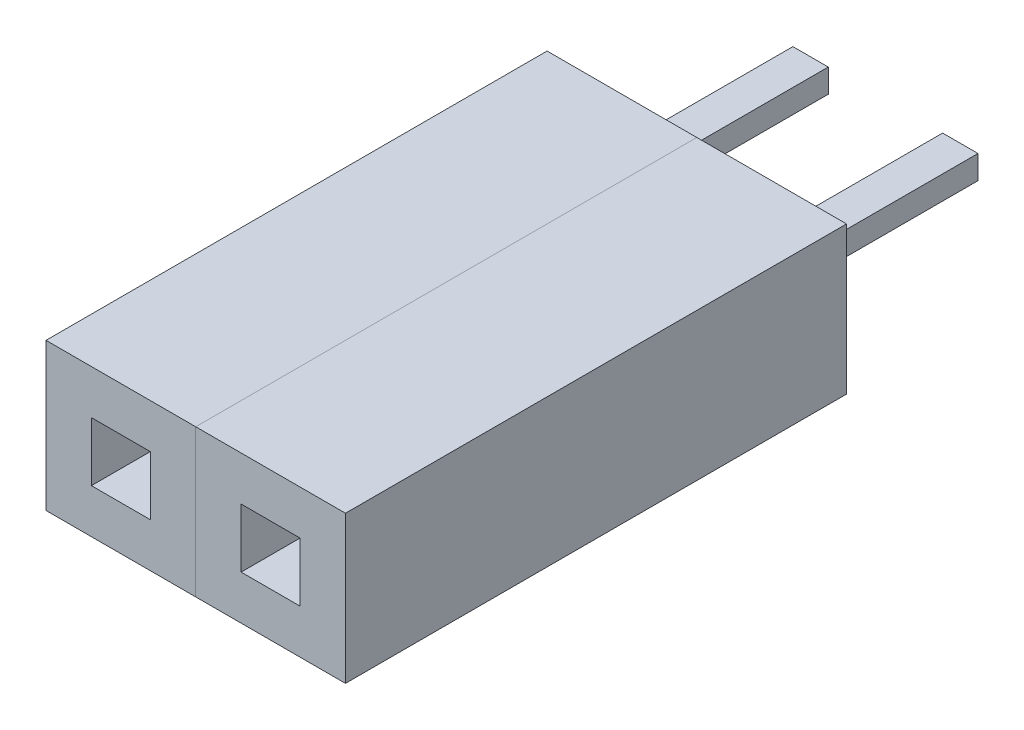
ISO-10303-21;
HEADER;
FILE_DESCRIPTION(('STEP AP214'),'2;1');
FILE_NAME('part.step','',(''),(''),'','','');
FILE_SCHEMA(('AUTOMOTIVE_DESIGN { 1 0 10303 214 1 1 1 1 }'));
ENDSEC;
DATA;
#1=APPLICATION_CONTEXT('core data for automotive mechanical design processes');
#2=APPLICATION_PROTOCOL_DEFINITION('international standard','automotive_design',2000,#1);
#3=PRODUCT_CONTEXT('',#1,'mechanical');
#4=PRODUCT('Part','Part','',(#3));
#5=PRODUCT_RELATED_PRODUCT_CATEGORY('part','',(#4));
#6=PRODUCT_DEFINITION_FORMATION('','',#4);
#7=PRODUCT_DEFINITION_CONTEXT('part definition',#1,'design');
#8=PRODUCT_DEFINITION('design','',#6,#7);
#9=PRODUCT_DEFINITION_SHAPE('','',#8);
#10=(LENGTH_UNIT() NAMED_UNIT(*) SI_UNIT(.MILLI.,.METRE.));
#11=(NAMED_UNIT(*) PLANE_ANGLE_UNIT() SI_UNIT($,.RADIAN.));
#12=(NAMED_UNIT(*) SI_UNIT($,.STERADIAN.) SOLID_ANGLE_UNIT());
#13=UNCERTAINTY_MEASURE_WITH_UNIT(LENGTH_MEASURE(1.E-05),#10,'distance_accuracy_value','');
#14=(GEOMETRIC_REPRESENTATION_CONTEXT(3) GLOBAL_UNCERTAINTY_ASSIGNED_CONTEXT((#13)) GLOBAL_UNIT_ASSIGNED_CONTEXT((#10,
#11,#12)) REPRESENTATION_CONTEXT('',''));
#15=CARTESIAN_POINT('',(0.,0.,0.));
#16=DIRECTION('',(0.,0.,1.));
#17=DIRECTION('',(1.,0.,0.));
#18=AXIS2_PLACEMENT_3D('',#15,#16,#17);
#19=CARTESIAN_POINT('',(22.48,-19.4244444444445,8.5));
#20=DIRECTION('',(0.,1.,0.));
#21=DIRECTION('',(1.,0.,0.));
#22=AXIS2_PLACEMENT_3D('',#19,#20,#21);
#23=PLANE('',#22);
#24=DIRECTION('',(1.,0.,0.));
#25=VECTOR('',#24,1.);
#26=CARTESIAN_POINT('',(22.48,-19.4244444444445,0.));
#27=LINE('',#26,#25);
#28=CARTESIAN_POINT('',(22.48,-19.4244444444445,0.));
#29=VERTEX_POINT('',#28);
#30=CARTESIAN_POINT('',(25.02,-19.4244444444445,0.));
#31=VERTEX_POINT('',#30);
#32=EDGE_CURVE('P0_E133',#29,#31,#27,.T.);
#33=ORIENTED_EDGE('',*,*,#32,.T.);
#34=DIRECTION('',(0.,0.,-1.));
#35=VECTOR('',#34,1.);
#36=CARTESIAN_POINT('',(25.02,-19.4244444444445,8.5));
#37=LINE('',#36,#35);
#38=CARTESIAN_POINT('',(25.02,-19.4244444444445,8.5));
#39=VERTEX_POINT('',#38);
#40=EDGE_CURVE('P0_E143',#39,#31,#37,.T.);
#41=ORIENTED_EDGE('',*,*,#40,.F.);
#42=DIRECTION('',(1.,0.,0.));
#43=VECTOR('',#42,1.);
#44=CARTESIAN_POINT('',(22.48,-19.4244444444445,8.5));
#45=LINE('',#44,#43);
#46=CARTESIAN_POINT('',(22.48,-19.4244444444445,8.5));
#47=VERTEX_POINT('',#46);
#48=EDGE_CURVE('P0_E148',#47,#39,#45,.T.);
#49=ORIENTED_EDGE('',*,*,#48,.F.);
#50=DIRECTION('',(0.,0.,-1.));
#51=VECTOR('',#50,1.);
#52=CARTESIAN_POINT('',(22.48,-19.4244444444445,8.5));
#53=LINE('',#52,#51);
#54=EDGE_CURVE('P0_E116',#47,#29,#53,.T.);
#55=ORIENTED_EDGE('',*,*,#54,.T.);
#56=EDGE_LOOP('',(#33,#41,#49,#55));
#57=FACE_BOUND('',#56,.T.);
#58=ADVANCED_FACE('P0_F17',(#57),#23,.F.);
#59=CARTESIAN_POINT('',(23.25,-17.6744444444444,1.5));
#60=DIRECTION('',(0.,0.,-1.));
#61=DIRECTION('',(0.,-1.,0.));
#62=AXIS2_PLACEMENT_3D('',#59,#60,#61);
#63=PLANE('',#62);
#64=DIRECTION('',(0.,1.,0.));
#65=VECTOR('',#64,1.);
#66=CARTESIAN_POINT('',(23.25,-18.6744444444444,1.5));
#67=LINE('',#66,#65);
#68=CARTESIAN_POINT('',(23.25,-18.6744444444444,1.5));
#69=VERTEX_POINT('',#68);
#70=CARTESIAN_POINT('',(23.25,-17.6744444444444,1.5));
#71=VERTEX_POINT('',#70);
#72=EDGE_CURVE('P0_E21',#69,#71,#67,.T.);
#73=ORIENTED_EDGE('',*,*,#72,.F.);
#74=DIRECTION('',(-1.,0.,0.));
#75=VECTOR('',#74,1.);
#76=CARTESIAN_POINT('',(24.25,-18.6744444444444,1.5));
#77=LINE('',#76,#75);
#78=CARTESIAN_POINT('',(24.25,-18.6744444444444,1.5));
#79=VERTEX_POINT('',#78);
#80=EDGE_CURVE('P0_E11',#79,#69,#77,.T.);
#81=ORIENTED_EDGE('',*,*,#80,.F.);
#82=DIRECTION('',(0.,-1.,0.));
#83=VECTOR('',#82,1.);
#84=CARTESIAN_POINT('',(24.25,-17.6744444444444,1.5));
#85=LINE('',#84,#83);
#86=CARTESIAN_POINT('',(24.25,-17.6744444444444,1.5));
#87=VERTEX_POINT('',#86);
#88=EDGE_CURVE('P0_E94',#87,#79,#85,.T.);
#89=ORIENTED_EDGE('',*,*,#88,.F.);
#90=DIRECTION('',(1.,0.,0.));
#91=VECTOR('',#90,1.);
#92=CARTESIAN_POINT('',(23.25,-17.6744444444444,1.5));
#93=LINE('',#92,#91);
#94=EDGE_CURVE('P0_E88',#71,#87,#93,.T.);
#95=ORIENTED_EDGE('',*,*,#94,.F.);
#96=EDGE_LOOP('',(#73,#81,#89,#95));
#97=FACE_BOUND('',#96,.T.);
#98=ADVANCED_FACE('P0_F90',(#97),#63,.F.);
#99=CARTESIAN_POINT('',(24.25,-18.6744444444444,1.5));
#100=DIRECTION('',(0.,1.,0.));
#101=DIRECTION('',(1.,0.,0.));
#102=AXIS2_PLACEMENT_3D('',#99,#100,#101);
#103=PLANE('',#102);
#104=DIRECTION('',(-1.,0.,0.));
#105=VECTOR('',#104,1.);
#106=CARTESIAN_POINT('',(24.25,-18.6744444444444,8.5));
#107=LINE('',#106,#105);
#108=CARTESIAN_POINT('',(24.25,-18.6744444444444,8.5));
#109=VERTEX_POINT('',#108);
#110=CARTESIAN_POINT('',(23.25,-18.6744444444444,8.5));
#111=VERTEX_POINT('',#110);
#112=EDGE_CURVE('P0_E147',#109,#111,#107,.T.);
#113=ORIENTED_EDGE('',*,*,#112,.F.);
#114=DIRECTION('',(0.,0.,1.));
#115=VECTOR('',#114,1.);
#116=CARTESIAN_POINT('',(24.25,-18.6744444444444,1.5));
#117=LINE('',#116,#115);
#118=EDGE_CURVE('P0_E28',#79,#109,#117,.T.);
#119=ORIENTED_EDGE('',*,*,#118,.F.);
#120=ORIENTED_EDGE('',*,*,#80,.T.);
#121=DIRECTION('',(0.,0.,1.));
#122=VECTOR('',#121,1.);
#123=CARTESIAN_POINT('',(23.25,-18.6744444444444,1.5));
#124=LINE('',#123,#122);
#125=EDGE_CURVE('P0_E110',#69,#111,#124,.T.);
#126=ORIENTED_EDGE('',*,*,#125,.T.);
#127=EDGE_LOOP('',(#113,#119,#120,#126));
#128=FACE_BOUND('',#127,.T.);
#129=ADVANCED_FACE('P0_F249',(#128),#103,.T.);
#130=CARTESIAN_POINT('',(24.25,-17.6744444444444,1.5));
#131=DIRECTION('',(-1.,0.,0.));
#132=DIRECTION('',(0.,0.,1.));
#133=AXIS2_PLACEMENT_3D('',#130,#131,#132);
#134=PLANE('',#133);
#135=DIRECTION('',(0.,-1.,0.));
#136=VECTOR('',#135,1.);
#137=CARTESIAN_POINT('',(24.25,-17.6744444444444,8.5));
#138=LINE('',#137,#136);
#139=CARTESIAN_POINT('',(24.25,-17.6744444444444,8.5));
#140=VERTEX_POINT('',#139);
#141=EDGE_CURVE('P0_E123',#140,#109,#138,.T.);
#142=ORIENTED_EDGE('',*,*,#141,.F.);
#143=DIRECTION('',(0.,0.,1.));
#144=VECTOR('',#143,1.);
#145=CARTESIAN_POINT('',(24.25,-17.6744444444444,1.5));
#146=LINE('',#145,#144);
#147=EDGE_CURVE('P0_E98',#87,#140,#146,.T.);
#148=ORIENTED_EDGE('',*,*,#147,.F.);
#149=ORIENTED_EDGE('',*,*,#88,.T.);
#150=ORIENTED_EDGE('',*,*,#118,.T.);
#151=EDGE_LOOP('',(#142,#148,#149,#150));
#152=FACE_BOUND('',#151,.T.);
#153=ADVANCED_FACE('P0_F245',(#152),#134,.T.);
#154=CARTESIAN_POINT('',(23.25,-17.6744444444444,1.5));
#155=DIRECTION('',(0.,-1.,0.));
#156=DIRECTION('',(0.,0.,-1.));
#157=AXIS2_PLACEMENT_3D('',#154,#155,#156);
#158=PLANE('',#157);
#159=DIRECTION('',(1.,0.,0.));
#160=VECTOR('',#159,1.);
#161=CARTESIAN_POINT('',(23.25,-17.6744444444444,8.5));
#162=LINE('',#161,#160);
#163=CARTESIAN_POINT('',(23.25,-17.6744444444444,8.5));
#164=VERTEX_POINT('',#163);
#165=EDGE_CURVE('P0_E104',#164,#140,#162,.T.);
#166=ORIENTED_EDGE('',*,*,#165,.F.);
#167=DIRECTION('',(0.,0.,1.));
#168=VECTOR('',#167,1.);
#169=CARTESIAN_POINT('',(23.25,-17.6744444444444,1.5));
#170=LINE('',#169,#168);
#171=EDGE_CURVE('P0_E99',#71,#164,#170,.T.);
#172=ORIENTED_EDGE('',*,*,#171,.F.);
#173=ORIENTED_EDGE('',*,*,#94,.T.);
#174=ORIENTED_EDGE('',*,*,#147,.T.);
#175=EDGE_LOOP('',(#166,#172,#173,#174));
#176=FACE_BOUND('',#175,.T.);
#177=ADVANCED_FACE('P0_F102',(#176),#158,.T.);
#178=CARTESIAN_POINT('',(23.25,-18.6744444444444,1.5));
#179=DIRECTION('',(1.,0.,0.));
#180=DIRECTION('',(0.,1.,0.));
#181=AXIS2_PLACEMENT_3D('',#178,#179,#180);
#182=PLANE('',#181);
#183=DIRECTION('',(0.,1.,0.));
#184=VECTOR('',#183,1.);
#185=CARTESIAN_POINT('',(23.25,-18.6744444444444,8.5));
#186=LINE('',#185,#184);
#187=EDGE_CURVE('P0_E144',#111,#164,#186,.T.);
#188=ORIENTED_EDGE('',*,*,#187,.F.);
#189=ORIENTED_EDGE('',*,*,#125,.F.);
#190=ORIENTED_EDGE('',*,*,#72,.T.);
#191=ORIENTED_EDGE('',*,*,#171,.T.);
#192=EDGE_LOOP('',(#188,#189,#190,#191));
#193=FACE_BOUND('',#192,.T.);
#194=ADVANCED_FACE('P0_F19',(#193),#182,.T.);
#195=CARTESIAN_POINT('',(22.48,-16.9244444444444,8.5));
#196=DIRECTION('',(1.,0.,0.));
#197=DIRECTION('',(0.,1.,0.));
#198=AXIS2_PLACEMENT_3D('',#195,#196,#197);
#199=PLANE('',#198);
#200=DIRECTION('',(0.,-1.,0.));
#201=VECTOR('',#200,1.);
#202=CARTESIAN_POINT('',(22.48,-16.9244444444444,0.));
#203=LINE('',#202,#201);
#204=CARTESIAN_POINT('',(22.48,-16.9244444444444,0.));
#205=VERTEX_POINT('',#204);
#206=EDGE_CURVE('P0_E164',#205,#29,#203,.T.);
#207=ORIENTED_EDGE('',*,*,#206,.T.);
#208=ORIENTED_EDGE('',*,*,#54,.F.);
#209=DIRECTION('',(0.,-1.,0.));
#210=VECTOR('',#209,1.);
#211=CARTESIAN_POINT('',(22.48,-16.9244444444444,8.5));
#212=LINE('',#211,#210);
#213=CARTESIAN_POINT('',(22.48,-16.9244444444444,8.5));
#214=VERTEX_POINT('',#213);
#215=EDGE_CURVE('P0_E150',#214,#47,#212,.T.);
#216=ORIENTED_EDGE('',*,*,#215,.F.);
#217=DIRECTION('',(0.,0.,-1.));
#218=VECTOR('',#217,1.);
#219=CARTESIAN_POINT('',(22.48,-16.9244444444444,8.5));
#220=LINE('',#219,#218);
#221=EDGE_CURVE('P0_E126',#214,#205,#220,.T.);
#222=ORIENTED_EDGE('',*,*,#221,.T.);
#223=EDGE_LOOP('',(#207,#208,#216,#222));
#224=FACE_BOUND('',#223,.T.);
#225=ADVANCED_FACE('P0_F196',(#224),#199,.F.);
#226=CARTESIAN_POINT('',(22.48,-19.4244444444445,8.5));
#227=DIRECTION('',(0.,0.,1.));
#228=DIRECTION('',(1.,0.,0.));
#229=AXIS2_PLACEMENT_3D('',#226,#227,#228);
#230=PLANE('',#229);
#231=ORIENTED_EDGE('',*,*,#112,.T.);
#232=ORIENTED_EDGE('',*,*,#187,.T.);
#233=ORIENTED_EDGE('',*,*,#165,.T.);
#234=ORIENTED_EDGE('',*,*,#141,.T.);
#235=EDGE_LOOP('',(#231,#232,#233,#234));
#236=FACE_BOUND('',#235,.T.);
#237=ORIENTED_EDGE('',*,*,#215,.T.);
#238=ORIENTED_EDGE('',*,*,#48,.T.);
#239=DIRECTION('',(0.,1.,0.));
#240=VECTOR('',#239,1.);
#241=CARTESIAN_POINT('',(25.02,-19.4244444444445,8.5));
#242=LINE('',#241,#240);
#243=CARTESIAN_POINT('',(25.02,-16.9244444444444,8.5));
#244=VERTEX_POINT('',#243);
#245=EDGE_CURVE('P0_E136',#39,#244,#242,.T.);
#246=ORIENTED_EDGE('',*,*,#245,.T.);
#247=DIRECTION('',(-1.,0.,0.));
#248=VECTOR('',#247,1.);
#249=CARTESIAN_POINT('',(25.02,-16.9244444444444,8.5));
#250=LINE('',#249,#248);
#251=EDGE_CURVE('P0_E179',#244,#214,#250,.T.);
#252=ORIENTED_EDGE('',*,*,#251,.T.);
#253=EDGE_LOOP('',(#237,#238,#246,#252));
#254=FACE_BOUND('',#253,.T.);
#255=ADVANCED_FACE('P0_F278',(#236,#254),#230,.T.);
#256=CARTESIAN_POINT('',(25.02,-19.4244444444445,8.5));
#257=DIRECTION('',(-1.,0.,0.));
#258=DIRECTION('',(0.,0.,1.));
#259=AXIS2_PLACEMENT_3D('',#256,#257,#258);
#260=PLANE('',#259);
#261=DIRECTION('',(0.,1.,0.));
#262=VECTOR('',#261,1.);
#263=CARTESIAN_POINT('',(25.02,-19.4244444444445,0.));
#264=LINE('',#263,#262);
#265=CARTESIAN_POINT('',(25.02,-16.9244444444444,0.));
#266=VERTEX_POINT('',#265);
#267=EDGE_CURVE('P0_E137',#31,#266,#264,.T.);
#268=ORIENTED_EDGE('',*,*,#267,.T.);
#269=DIRECTION('',(0.,0.,-1.));
#270=VECTOR('',#269,1.);
#271=CARTESIAN_POINT('',(25.02,-16.9244444444444,8.5));
#272=LINE('',#271,#270);
#273=EDGE_CURVE('P0_E180',#244,#266,#272,.T.);
#274=ORIENTED_EDGE('',*,*,#273,.F.);
#275=ORIENTED_EDGE('',*,*,#245,.F.);
#276=ORIENTED_EDGE('',*,*,#40,.T.);
#277=EDGE_LOOP('',(#268,#274,#275,#276));
#278=FACE_BOUND('',#277,.T.);
#279=ADVANCED_FACE('P0_F268',(#278),#260,.F.);
#280=CARTESIAN_POINT('',(22.48,-19.4244444444445,0.));
#281=DIRECTION('',(0.,0.,1.));
#282=DIRECTION('',(1.,0.,0.));
#283=AXIS2_PLACEMENT_3D('',#280,#281,#282);
#284=PLANE('',#283);
#285=ORIENTED_EDGE('',*,*,#206,.F.);
#286=DIRECTION('',(-1.,0.,0.));
#287=VECTOR('',#286,1.);
#288=CARTESIAN_POINT('',(25.02,-16.9244444444444,0.));
#289=LINE('',#288,#287);
#290=EDGE_CURVE('P0_E129',#266,#205,#289,.T.);
#291=ORIENTED_EDGE('',*,*,#290,.F.);
#292=ORIENTED_EDGE('',*,*,#267,.F.);
#293=ORIENTED_EDGE('',*,*,#32,.F.);
#294=EDGE_LOOP('',(#285,#291,#292,#293));
#295=FACE_BOUND('',#294,.T.);
#296=ADVANCED_FACE('P0_F202',(#295),#284,.F.);
#297=CARTESIAN_POINT('',(25.02,-16.9244444444444,8.5));
#298=DIRECTION('',(0.,-1.,0.));
#299=DIRECTION('',(0.,0.,-1.));
#300=AXIS2_PLACEMENT_3D('',#297,#298,#299);
#301=PLANE('',#300);
#302=ORIENTED_EDGE('',*,*,#290,.T.);
#303=ORIENTED_EDGE('',*,*,#221,.F.);
#304=ORIENTED_EDGE('',*,*,#251,.F.);
#305=ORIENTED_EDGE('',*,*,#273,.T.);
#306=EDGE_LOOP('',(#302,#303,#304,#305));
#307=FACE_BOUND('',#306,.T.);
#308=ADVANCED_FACE('P0_F225',(#307),#301,.F.);
#309=CLOSED_SHELL('',(#58,#98,#129,#153,#177,#194,#225,#255,#279,#296,#308));
#310=MANIFOLD_SOLID_BREP('P0_B1',#309);
#311=CARTESIAN_POINT('',(25.02,-19.4244444444445,8.5));
#312=DIRECTION('',(0.,1.,0.));
#313=DIRECTION('',(1.,0.,0.));
#314=AXIS2_PLACEMENT_3D('',#311,#312,#313);
#315=PLANE('',#314);
#316=DIRECTION('',(1.,0.,0.));
#317=VECTOR('',#316,1.);
#318=CARTESIAN_POINT('',(25.02,-19.4244444444445,0.));
#319=LINE('',#318,#317);
#320=CARTESIAN_POINT('',(25.02,-19.4244444444445,0.));
#321=VERTEX_POINT('',#320);
#322=CARTESIAN_POINT('',(27.56,-19.4244444444445,0.));
#323=VERTEX_POINT('',#322);
#324=EDGE_CURVE('P1_E133',#321,#323,#319,.T.);
#325=ORIENTED_EDGE('',*,*,#324,.T.);
#326=DIRECTION('',(0.,0.,-1.));
#327=VECTOR('',#326,1.);
#328=CARTESIAN_POINT('',(27.56,-19.4244444444445,8.5));
#329=LINE('',#328,#327);
#330=CARTESIAN_POINT('',(27.56,-19.4244444444445,8.5));
#331=VERTEX_POINT('',#330);
#332=EDGE_CURVE('P1_E143',#331,#323,#329,.T.);
#333=ORIENTED_EDGE('',*,*,#332,.F.);
#334=DIRECTION('',(1.,0.,0.));
#335=VECTOR('',#334,1.);
#336=CARTESIAN_POINT('',(25.02,-19.4244444444445,8.5));
#337=LINE('',#336,#335);
#338=CARTESIAN_POINT('',(25.02,-19.4244444444445,8.5));
#339=VERTEX_POINT('',#338);
#340=EDGE_CURVE('P1_E148',#339,#331,#337,.T.);
#341=ORIENTED_EDGE('',*,*,#340,.F.);
#342=DIRECTION('',(0.,0.,-1.));
#343=VECTOR('',#342,1.);
#344=CARTESIAN_POINT('',(25.02,-19.4244444444445,8.5));
#345=LINE('',#344,#343);
#346=EDGE_CURVE('P1_E116',#339,#321,#345,.T.);
#347=ORIENTED_EDGE('',*,*,#346,.T.);
#348=EDGE_LOOP('',(#325,#333,#341,#347));
#349=FACE_BOUND('',#348,.T.);
#350=ADVANCED_FACE('P1_F17',(#349),#315,.F.);
#351=CARTESIAN_POINT('',(25.79,-17.6744444444444,1.5));
#352=DIRECTION('',(0.,0.,-1.));
#353=DIRECTION('',(0.,-1.,0.));
#354=AXIS2_PLACEMENT_3D('',#351,#352,#353);
#355=PLANE('',#354);
#356=DIRECTION('',(0.,1.,0.));
#357=VECTOR('',#356,1.);
#358=CARTESIAN_POINT('',(25.79,-18.6744444444444,1.5));
#359=LINE('',#358,#357);
#360=CARTESIAN_POINT('',(25.79,-18.6744444444444,1.5));
#361=VERTEX_POINT('',#360);
#362=CARTESIAN_POINT('',(25.79,-17.6744444444444,1.5));
#363=VERTEX_POINT('',#362);
#364=EDGE_CURVE('P1_E21',#361,#363,#359,.T.);
#365=ORIENTED_EDGE('',*,*,#364,.F.);
#366=DIRECTION('',(-1.,0.,0.));
#367=VECTOR('',#366,1.);
#368=CARTESIAN_POINT('',(26.79,-18.6744444444444,1.5));
#369=LINE('',#368,#367);
#370=CARTESIAN_POINT('',(26.79,-18.6744444444444,1.5));
#371=VERTEX_POINT('',#370);
#372=EDGE_CURVE('P1_E11',#371,#361,#369,.T.);
#373=ORIENTED_EDGE('',*,*,#372,.F.);
#374=DIRECTION('',(0.,-1.,0.));
#375=VECTOR('',#374,1.);
#376=CARTESIAN_POINT('',(26.79,-17.6744444444444,1.5));
#377=LINE('',#376,#375);
#378=CARTESIAN_POINT('',(26.79,-17.6744444444444,1.5));
#379=VERTEX_POINT('',#378);
#380=EDGE_CURVE('P1_E94',#379,#371,#377,.T.);
#381=ORIENTED_EDGE('',*,*,#380,.F.);
#382=DIRECTION('',(1.,0.,0.));
#383=VECTOR('',#382,1.);
#384=CARTESIAN_POINT('',(25.79,-17.6744444444444,1.5));
#385=LINE('',#384,#383);
#386=EDGE_CURVE('P1_E88',#363,#379,#385,.T.);
#387=ORIENTED_EDGE('',*,*,#386,.F.);
#388=EDGE_LOOP('',(#365,#373,#381,#387));
#389=FACE_BOUND('',#388,.T.);
#390=ADVANCED_FACE('P1_F90',(#389),#355,.F.);
#391=CARTESIAN_POINT('',(26.79,-18.6744444444444,1.5));
#392=DIRECTION('',(0.,1.,0.));
#393=DIRECTION('',(1.,0.,0.));
#394=AXIS2_PLACEMENT_3D('',#391,#392,#393);
#395=PLANE('',#394);
#396=DIRECTION('',(-1.,0.,0.));
#397=VECTOR('',#396,1.);
#398=CARTESIAN_POINT('',(26.79,-18.6744444444444,8.5));
#399=LINE('',#398,#397);
#400=CARTESIAN_POINT('',(26.79,-18.6744444444444,8.5));
#401=VERTEX_POINT('',#400);
#402=CARTESIAN_POINT('',(25.79,-18.6744444444444,8.5));
#403=VERTEX_POINT('',#402);
#404=EDGE_CURVE('P1_E147',#401,#403,#399,.T.);
#405=ORIENTED_EDGE('',*,*,#404,.F.);
#406=DIRECTION('',(0.,0.,1.));
#407=VECTOR('',#406,1.);
#408=CARTESIAN_POINT('',(26.79,-18.6744444444444,1.5));
#409=LINE('',#408,#407);
#410=EDGE_CURVE('P1_E28',#371,#401,#409,.T.);
#411=ORIENTED_EDGE('',*,*,#410,.F.);
#412=ORIENTED_EDGE('',*,*,#372,.T.);
#413=DIRECTION('',(0.,0.,1.));
#414=VECTOR('',#413,1.);
#415=CARTESIAN_POINT('',(25.79,-18.6744444444444,1.5));
#416=LINE('',#415,#414);
#417=EDGE_CURVE('P1_E110',#361,#403,#416,.T.);
#418=ORIENTED_EDGE('',*,*,#417,.T.);
#419=EDGE_LOOP('',(#405,#411,#412,#418));
#420=FACE_BOUND('',#419,.T.);
#421=ADVANCED_FACE('P1_F256',(#420),#395,.T.);
#422=CARTESIAN_POINT('',(26.79,-17.6744444444444,1.5));
#423=DIRECTION('',(-1.,0.,0.));
#424=DIRECTION('',(0.,0.,1.));
#425=AXIS2_PLACEMENT_3D('',#422,#423,#424);
#426=PLANE('',#425);
#427=DIRECTION('',(0.,-1.,0.));
#428=VECTOR('',#427,1.);
#429=CARTESIAN_POINT('',(26.79,-17.6744444444444,8.5));
#430=LINE('',#429,#428);
#431=CARTESIAN_POINT('',(26.79,-17.6744444444444,8.5));
#432=VERTEX_POINT('',#431);
#433=EDGE_CURVE('P1_E123',#432,#401,#430,.T.);
#434=ORIENTED_EDGE('',*,*,#433,.F.);
#435=DIRECTION('',(0.,0.,1.));
#436=VECTOR('',#435,1.);
#437=CARTESIAN_POINT('',(26.79,-17.6744444444444,1.5));
#438=LINE('',#437,#436);
#439=EDGE_CURVE('P1_E98',#379,#432,#438,.T.);
#440=ORIENTED_EDGE('',*,*,#439,.F.);
#441=ORIENTED_EDGE('',*,*,#380,.T.);
#442=ORIENTED_EDGE('',*,*,#410,.T.);
#443=EDGE_LOOP('',(#434,#440,#441,#442));
#444=FACE_BOUND('',#443,.T.);
#445=ADVANCED_FACE('P1_F251',(#444),#426,.T.);
#446=CARTESIAN_POINT('',(25.79,-17.6744444444444,1.5));
#447=DIRECTION('',(0.,-1.,0.));
#448=DIRECTION('',(0.,0.,-1.));
#449=AXIS2_PLACEMENT_3D('',#446,#447,#448);
#450=PLANE('',#449);
#451=DIRECTION('',(1.,0.,0.));
#452=VECTOR('',#451,1.);
#453=CARTESIAN_POINT('',(25.79,-17.6744444444444,8.5));
#454=LINE('',#453,#452);
#455=CARTESIAN_POINT('',(25.79,-17.6744444444444,8.5));
#456=VERTEX_POINT('',#455);
#457=EDGE_CURVE('P1_E104',#456,#432,#454,.T.);
#458=ORIENTED_EDGE('',*,*,#457,.F.);
#459=DIRECTION('',(0.,0.,1.));
#460=VECTOR('',#459,1.);
#461=CARTESIAN_POINT('',(25.79,-17.6744444444444,1.5));
#462=LINE('',#461,#460);
#463=EDGE_CURVE('P1_E99',#363,#456,#462,.T.);
#464=ORIENTED_EDGE('',*,*,#463,.F.);
#465=ORIENTED_EDGE('',*,*,#386,.T.);
#466=ORIENTED_EDGE('',*,*,#439,.T.);
#467=EDGE_LOOP('',(#458,#464,#465,#466));
#468=FACE_BOUND('',#467,.T.);
#469=ADVANCED_FACE('P1_F102',(#468),#450,.T.);
#470=CARTESIAN_POINT('',(25.79,-18.6744444444444,1.5));
#471=DIRECTION('',(1.,0.,0.));
#472=DIRECTION('',(0.,1.,0.));
#473=AXIS2_PLACEMENT_3D('',#470,#471,#472);
#474=PLANE('',#473);
#475=DIRECTION('',(0.,1.,0.));
#476=VECTOR('',#475,1.);
#477=CARTESIAN_POINT('',(25.79,-18.6744444444444,8.5));
#478=LINE('',#477,#476);
#479=EDGE_CURVE('P1_E144',#403,#456,#478,.T.);
#480=ORIENTED_EDGE('',*,*,#479,.F.);
#481=ORIENTED_EDGE('',*,*,#417,.F.);
#482=ORIENTED_EDGE('',*,*,#364,.T.);
#483=ORIENTED_EDGE('',*,*,#463,.T.);
#484=EDGE_LOOP('',(#480,#481,#482,#483));
#485=FACE_BOUND('',#484,.T.);
#486=ADVANCED_FACE('P1_F19',(#485),#474,.T.);
#487=CARTESIAN_POINT('',(25.02,-16.9244444444444,8.5));
#488=DIRECTION('',(1.,0.,0.));
#489=DIRECTION('',(0.,1.,0.));
#490=AXIS2_PLACEMENT_3D('',#487,#488,#489);
#491=PLANE('',#490);
#492=DIRECTION('',(0.,-1.,0.));
#493=VECTOR('',#492,1.);
#494=CARTESIAN_POINT('',(25.02,-16.9244444444444,0.));
#495=LINE('',#494,#493);
#496=CARTESIAN_POINT('',(25.02,-16.9244444444444,0.));
#497=VERTEX_POINT('',#496);
#498=EDGE_CURVE('P1_E164',#497,#321,#495,.T.);
#499=ORIENTED_EDGE('',*,*,#498,.T.);
#500=ORIENTED_EDGE('',*,*,#346,.F.);
#501=DIRECTION('',(0.,-1.,0.));
#502=VECTOR('',#501,1.);
#503=CARTESIAN_POINT('',(25.02,-16.9244444444444,8.5));
#504=LINE('',#503,#502);
#505=CARTESIAN_POINT('',(25.02,-16.9244444444444,8.5));
#506=VERTEX_POINT('',#505);
#507=EDGE_CURVE('P1_E150',#506,#339,#504,.T.);
#508=ORIENTED_EDGE('',*,*,#507,.F.);
#509=DIRECTION('',(0.,0.,-1.));
#510=VECTOR('',#509,1.);
#511=CARTESIAN_POINT('',(25.02,-16.9244444444444,8.5));
#512=LINE('',#511,#510);
#513=EDGE_CURVE('P1_E126',#506,#497,#512,.T.);
#514=ORIENTED_EDGE('',*,*,#513,.T.);
#515=EDGE_LOOP('',(#499,#500,#508,#514));
#516=FACE_BOUND('',#515,.T.);
#517=ADVANCED_FACE('P1_F196',(#516),#491,.F.);
#518=CARTESIAN_POINT('',(25.02,-19.4244444444445,8.5));
#519=DIRECTION('',(0.,0.,1.));
#520=DIRECTION('',(1.,0.,0.));
#521=AXIS2_PLACEMENT_3D('',#518,#519,#520);
#522=PLANE('',#521);
#523=ORIENTED_EDGE('',*,*,#404,.T.);
#524=ORIENTED_EDGE('',*,*,#479,.T.);
#525=ORIENTED_EDGE('',*,*,#457,.T.);
#526=ORIENTED_EDGE('',*,*,#433,.T.);
#527=EDGE_LOOP('',(#523,#524,#525,#526));
#528=FACE_BOUND('',#527,.T.);
#529=ORIENTED_EDGE('',*,*,#507,.T.);
#530=ORIENTED_EDGE('',*,*,#340,.T.);
#531=DIRECTION('',(0.,1.,0.));
#532=VECTOR('',#531,1.);
#533=CARTESIAN_POINT('',(27.56,-19.4244444444445,8.5));
#534=LINE('',#533,#532);
#535=CARTESIAN_POINT('',(27.56,-16.9244444444444,8.5));
#536=VERTEX_POINT('',#535);
#537=EDGE_CURVE('P1_E136',#331,#536,#534,.T.);
#538=ORIENTED_EDGE('',*,*,#537,.T.);
#539=DIRECTION('',(-1.,0.,0.));
#540=VECTOR('',#539,1.);
#541=CARTESIAN_POINT('',(27.56,-16.9244444444444,8.5));
#542=LINE('',#541,#540);
#543=EDGE_CURVE('P1_E179',#536,#506,#542,.T.);
#544=ORIENTED_EDGE('',*,*,#543,.T.);
#545=EDGE_LOOP('',(#529,#530,#538,#544));
#546=FACE_BOUND('',#545,.T.);
#547=ADVANCED_FACE('P1_F287',(#528,#546),#522,.T.);
#548=CARTESIAN_POINT('',(27.56,-19.4244444444445,8.5));
#549=DIRECTION('',(-1.,0.,0.));
#550=DIRECTION('',(0.,0.,1.));
#551=AXIS2_PLACEMENT_3D('',#548,#549,#550);
#552=PLANE('',#551);
#553=DIRECTION('',(0.,1.,0.));
#554=VECTOR('',#553,1.);
#555=CARTESIAN_POINT('',(27.56,-19.4244444444445,0.));
#556=LINE('',#555,#554);
#557=CARTESIAN_POINT('',(27.56,-16.9244444444444,0.));
#558=VERTEX_POINT('',#557);
#559=EDGE_CURVE('P1_E137',#323,#558,#556,.T.);
#560=ORIENTED_EDGE('',*,*,#559,.T.);
#561=DIRECTION('',(0.,0.,-1.));
#562=VECTOR('',#561,1.);
#563=CARTESIAN_POINT('',(27.56,-16.9244444444444,8.5));
#564=LINE('',#563,#562);
#565=EDGE_CURVE('P1_E180',#536,#558,#564,.T.);
#566=ORIENTED_EDGE('',*,*,#565,.F.);
#567=ORIENTED_EDGE('',*,*,#537,.F.);
#568=ORIENTED_EDGE('',*,*,#332,.T.);
#569=EDGE_LOOP('',(#560,#566,#567,#568));
#570=FACE_BOUND('',#569,.T.);
#571=ADVANCED_FACE('P1_F276',(#570),#552,.F.);
#572=CARTESIAN_POINT('',(25.02,-19.4244444444445,0.));
#573=DIRECTION('',(0.,0.,1.));
#574=DIRECTION('',(1.,0.,0.));
#575=AXIS2_PLACEMENT_3D('',#572,#573,#574);
#576=PLANE('',#575);
#577=ORIENTED_EDGE('',*,*,#498,.F.);
#578=DIRECTION('',(-1.,0.,0.));
#579=VECTOR('',#578,1.);
#580=CARTESIAN_POINT('',(27.56,-16.9244444444444,0.));
#581=LINE('',#580,#579);
#582=EDGE_CURVE('P1_E129',#558,#497,#581,.T.);
#583=ORIENTED_EDGE('',*,*,#582,.F.);
#584=ORIENTED_EDGE('',*,*,#559,.F.);
#585=ORIENTED_EDGE('',*,*,#324,.F.);
#586=EDGE_LOOP('',(#577,#583,#584,#585));
#587=FACE_BOUND('',#586,.T.);
#588=ADVANCED_FACE('P1_F202',(#587),#576,.F.);
#589=CARTESIAN_POINT('',(27.56,-16.9244444444444,8.5));
#590=DIRECTION('',(0.,-1.,0.));
#591=DIRECTION('',(0.,0.,-1.));
#592=AXIS2_PLACEMENT_3D('',#589,#590,#591);
#593=PLANE('',#592);
#594=ORIENTED_EDGE('',*,*,#582,.T.);
#595=ORIENTED_EDGE('',*,*,#513,.F.);
#596=ORIENTED_EDGE('',*,*,#543,.F.);
#597=ORIENTED_EDGE('',*,*,#565,.T.);
#598=EDGE_LOOP('',(#594,#595,#596,#597));
#599=FACE_BOUND('',#598,.T.);
#600=ADVANCED_FACE('P1_F227',(#599),#593,.F.);
#601=CLOSED_SHELL('',(#350,#390,#421,#445,#469,#486,#517,#547,#571,#588,#600));
#602=MANIFOLD_SOLID_BREP('P1_B1',#601);
#603=CARTESIAN_POINT('',(23.45,-17.974444444444,-3.2));
#604=DIRECTION('',(0.,0.,-1.));
#605=DIRECTION('',(1.,0.,0.));
#606=AXIS2_PLACEMENT_3D('',#603,#604,#605);
#607=PLANE('',#606);
#608=DIRECTION('',(0.,1.,0.));
#609=VECTOR('',#608,1.);
#610=CARTESIAN_POINT('',(23.45,-18.374444444444,-3.2));
#611=LINE('',#610,#609);
#612=CARTESIAN_POINT('',(23.45,-18.374444444444,-3.2));
#613=VERTEX_POINT('',#612);
#614=CARTESIAN_POINT('',(23.45,-17.974444444444,-3.2));
#615=VERTEX_POINT('',#614);
#616=EDGE_CURVE('P2_E93',#613,#615,#611,.T.);
#617=ORIENTED_EDGE('',*,*,#616,.T.);
#618=DIRECTION('',(1.,0.,0.));
#619=VECTOR('',#618,1.);
#620=CARTESIAN_POINT('',(23.45,-17.974444444444,-3.2));
#621=LINE('',#620,#619);
#622=CARTESIAN_POINT('',(24.05,-17.974444444444,-3.2));
#623=VERTEX_POINT('',#622);
#624=EDGE_CURVE('P2_E69',#615,#623,#621,.T.);
#625=ORIENTED_EDGE('',*,*,#624,.T.);
#626=DIRECTION('',(0.,-1.,0.));
#627=VECTOR('',#626,1.);
#628=CARTESIAN_POINT('',(24.05,-17.974444444444,-3.2));
#629=LINE('',#628,#627);
#630=CARTESIAN_POINT('',(24.05,-18.374444444444,-3.2));
#631=VERTEX_POINT('',#630);
#632=EDGE_CURVE('P2_E21',#623,#631,#629,.T.);
#633=ORIENTED_EDGE('',*,*,#632,.T.);
#634=DIRECTION('',(-1.,0.,0.));
#635=VECTOR('',#634,1.);
#636=CARTESIAN_POINT('',(24.05,-18.374444444444,-3.2));
#637=LINE('',#636,#635);
#638=EDGE_CURVE('P2_E11',#631,#613,#637,.T.);
#639=ORIENTED_EDGE('',*,*,#638,.T.);
#640=EDGE_LOOP('',(#617,#625,#633,#639));
#641=FACE_BOUND('',#640,.T.);
#642=ADVANCED_FACE('P2_F17',(#641),#607,.T.);
#643=CARTESIAN_POINT('',(23.45,-17.974444444444,0.));
#644=DIRECTION('',(0.,0.,-1.));
#645=DIRECTION('',(1.,0.,0.));
#646=AXIS2_PLACEMENT_3D('',#643,#644,#645);
#647=PLANE('',#646);
#648=DIRECTION('',(0.,1.,0.));
#649=VECTOR('',#648,1.);
#650=CARTESIAN_POINT('',(23.45,-18.374444444444,0.));
#651=LINE('',#650,#649);
#652=CARTESIAN_POINT('',(23.45,-18.374444444444,0.));
#653=VERTEX_POINT('',#652);
#654=CARTESIAN_POINT('',(23.45,-17.974444444444,0.));
#655=VERTEX_POINT('',#654);
#656=EDGE_CURVE('P2_E92',#653,#655,#651,.T.);
#657=ORIENTED_EDGE('',*,*,#656,.F.);
#658=DIRECTION('',(-1.,0.,0.));
#659=VECTOR('',#658,1.);
#660=CARTESIAN_POINT('',(24.05,-18.374444444444,0.));
#661=LINE('',#660,#659);
#662=CARTESIAN_POINT('',(24.05,-18.374444444444,0.));
#663=VERTEX_POINT('',#662);
#664=EDGE_CURVE('P2_E28',#663,#653,#661,.T.);
#665=ORIENTED_EDGE('',*,*,#664,.F.);
#666=DIRECTION('',(0.,-1.,0.));
#667=VECTOR('',#666,1.);
#668=CARTESIAN_POINT('',(24.05,-17.974444444444,0.));
#669=LINE('',#668,#667);
#670=CARTESIAN_POINT('',(24.05,-17.974444444444,0.));
#671=VERTEX_POINT('',#670);
#672=EDGE_CURVE('P2_E107',#671,#663,#669,.T.);
#673=ORIENTED_EDGE('',*,*,#672,.F.);
#674=DIRECTION('',(1.,0.,0.));
#675=VECTOR('',#674,1.);
#676=CARTESIAN_POINT('',(23.45,-17.974444444444,0.));
#677=LINE('',#676,#675);
#678=EDGE_CURVE('P2_E76',#655,#671,#677,.T.);
#679=ORIENTED_EDGE('',*,*,#678,.F.);
#680=EDGE_LOOP('',(#657,#665,#673,#679));
#681=FACE_BOUND('',#680,.T.);
#682=ADVANCED_FACE('P2_F96',(#681),#647,.F.);
#683=CARTESIAN_POINT('',(24.05,-18.374444444444,-3.2));
#684=DIRECTION('',(0.,1.,0.));
#685=DIRECTION('',(0.,0.,1.));
#686=AXIS2_PLACEMENT_3D('',#683,#684,#685);
#687=PLANE('',#686);
#688=ORIENTED_EDGE('',*,*,#664,.T.);
#689=DIRECTION('',(0.,0.,1.));
#690=VECTOR('',#689,1.);
#691=CARTESIAN_POINT('',(23.45,-18.374444444444,-3.2));
#692=LINE('',#691,#690);
#693=EDGE_CURVE('P2_E81',#613,#653,#692,.T.);
#694=ORIENTED_EDGE('',*,*,#693,.F.);
#695=ORIENTED_EDGE('',*,*,#638,.F.);
#696=DIRECTION('',(0.,0.,1.));
#697=VECTOR('',#696,1.);
#698=CARTESIAN_POINT('',(24.05,-18.374444444444,-3.2));
#699=LINE('',#698,#697);
#700=EDGE_CURVE('P2_E84',#631,#663,#699,.T.);
#701=ORIENTED_EDGE('',*,*,#700,.T.);
#702=EDGE_LOOP('',(#688,#694,#695,#701));
#703=FACE_BOUND('',#702,.T.);
#704=ADVANCED_FACE('P2_F19',(#703),#687,.F.);
#705=CARTESIAN_POINT('',(24.05,-17.974444444444,-3.2));
#706=DIRECTION('',(-1.,0.,0.));
#707=DIRECTION('',(0.,0.,-1.));
#708=AXIS2_PLACEMENT_3D('',#705,#706,#707);
#709=PLANE('',#708);
#710=ORIENTED_EDGE('',*,*,#672,.T.);
#711=ORIENTED_EDGE('',*,*,#700,.F.);
#712=ORIENTED_EDGE('',*,*,#632,.F.);
#713=DIRECTION('',(0.,0.,1.));
#714=VECTOR('',#713,1.);
#715=CARTESIAN_POINT('',(24.05,-17.974444444444,-3.2));
#716=LINE('',#715,#714);
#717=EDGE_CURVE('P2_E108',#623,#671,#716,.T.);
#718=ORIENTED_EDGE('',*,*,#717,.T.);
#719=EDGE_LOOP('',(#710,#711,#712,#718));
#720=FACE_BOUND('',#719,.T.);
#721=ADVANCED_FACE('P2_F124',(#720),#709,.F.);
#722=CARTESIAN_POINT('',(23.45,-17.974444444444,-3.2));
#723=DIRECTION('',(0.,-1.,0.));
#724=DIRECTION('',(1.,0.,0.));
#725=AXIS2_PLACEMENT_3D('',#722,#723,#724);
#726=PLANE('',#725);
#727=ORIENTED_EDGE('',*,*,#678,.T.);
#728=ORIENTED_EDGE('',*,*,#717,.F.);
#729=ORIENTED_EDGE('',*,*,#624,.F.);
#730=DIRECTION('',(0.,0.,1.));
#731=VECTOR('',#730,1.);
#732=CARTESIAN_POINT('',(23.45,-17.974444444444,-3.2));
#733=LINE('',#732,#731);
#734=EDGE_CURVE('P2_E98',#615,#655,#733,.T.);
#735=ORIENTED_EDGE('',*,*,#734,.T.);
#736=EDGE_LOOP('',(#727,#728,#729,#735));
#737=FACE_BOUND('',#736,.T.);
#738=ADVANCED_FACE('P2_F126',(#737),#726,.F.);
#739=CARTESIAN_POINT('',(23.45,-18.374444444444,-3.2));
#740=DIRECTION('',(1.,0.,0.));
#741=DIRECTION('',(0.,-1.,0.));
#742=AXIS2_PLACEMENT_3D('',#739,#740,#741);
#743=PLANE('',#742);
#744=ORIENTED_EDGE('',*,*,#656,.T.);
#745=ORIENTED_EDGE('',*,*,#734,.F.);
#746=ORIENTED_EDGE('',*,*,#616,.F.);
#747=ORIENTED_EDGE('',*,*,#693,.T.);
#748=EDGE_LOOP('',(#744,#745,#746,#747));
#749=FACE_BOUND('',#748,.T.);
#750=ADVANCED_FACE('P2_F90',(#749),#743,.F.);
#751=CLOSED_SHELL('',(#642,#682,#704,#721,#738,#750));
#752=MANIFOLD_SOLID_BREP('P2_B1',#751);
#753=CARTESIAN_POINT('',(25.99,-17.974444444444,-3.2));
#754=DIRECTION('',(0.,0.,-1.));
#755=DIRECTION('',(1.,0.,0.));
#756=AXIS2_PLACEMENT_3D('',#753,#754,#755);
#757=PLANE('',#756);
#758=DIRECTION('',(0.,1.,0.));
#759=VECTOR('',#758,1.);
#760=CARTESIAN_POINT('',(25.99,-18.374444444444,-3.2));
#761=LINE('',#760,#759);
#762=CARTESIAN_POINT('',(25.99,-18.374444444444,-3.2));
#763=VERTEX_POINT('',#762);
#764=CARTESIAN_POINT('',(25.99,-17.974444444444,-3.2));
#765=VERTEX_POINT('',#764);
#766=EDGE_CURVE('P3_E92',#763,#765,#761,.T.);
#767=ORIENTED_EDGE('',*,*,#766,.T.);
#768=DIRECTION('',(1.,0.,0.));
#769=VECTOR('',#768,1.);
#770=CARTESIAN_POINT('',(25.99,-17.974444444444,-3.2));
#771=LINE('',#770,#769);
#772=CARTESIAN_POINT('',(26.59,-17.974444444444,-3.2));
#773=VERTEX_POINT('',#772);
#774=EDGE_CURVE('P3_E68',#765,#773,#771,.T.);
#775=ORIENTED_EDGE('',*,*,#774,.T.);
#776=DIRECTION('',(0.,-1.,0.));
#777=VECTOR('',#776,1.);
#778=CARTESIAN_POINT('',(26.59,-17.974444444444,-3.2));
#779=LINE('',#778,#777);
#780=CARTESIAN_POINT('',(26.59,-18.374444444444,-3.2));
#781=VERTEX_POINT('',#780);
#782=EDGE_CURVE('P3_E20',#773,#781,#779,.T.);
#783=ORIENTED_EDGE('',*,*,#782,.T.);
#784=DIRECTION('',(-1.,0.,0.));
#785=VECTOR('',#784,1.);
#786=CARTESIAN_POINT('',(26.59,-18.374444444444,-3.2));
#787=LINE('',#786,#785);
#788=EDGE_CURVE('P3_E10',#781,#763,#787,.T.);
#789=ORIENTED_EDGE('',*,*,#788,.T.);
#790=EDGE_LOOP('',(#767,#775,#783,#789));
#791=FACE_BOUND('',#790,.T.);
#792=ADVANCED_FACE('P3_F16',(#791),#757,.T.);
#793=CARTESIAN_POINT('',(25.99,-17.974444444444,0.));
#794=DIRECTION('',(0.,0.,-1.));
#795=DIRECTION('',(1.,0.,0.));
#796=AXIS2_PLACEMENT_3D('',#793,#794,#795);
#797=PLANE('',#796);
#798=DIRECTION('',(0.,1.,0.));
#799=VECTOR('',#798,1.);
#800=CARTESIAN_POINT('',(25.99,-18.374444444444,0.));
#801=LINE('',#800,#799);
#802=CARTESIAN_POINT('',(25.99,-18.374444444444,0.));
#803=VERTEX_POINT('',#802);
#804=CARTESIAN_POINT('',(25.99,-17.974444444444,0.));
#805=VERTEX_POINT('',#804);
#806=EDGE_CURVE('P3_E91',#803,#805,#801,.T.);
#807=ORIENTED_EDGE('',*,*,#806,.F.);
#808=DIRECTION('',(-1.,0.,0.));
#809=VECTOR('',#808,1.);
#810=CARTESIAN_POINT('',(26.59,-18.374444444444,0.));
#811=LINE('',#810,#809);
#812=CARTESIAN_POINT('',(26.59,-18.374444444444,0.));
#813=VERTEX_POINT('',#812);
#814=EDGE_CURVE('P3_E27',#813,#803,#811,.T.);
#815=ORIENTED_EDGE('',*,*,#814,.F.);
#816=DIRECTION('',(0.,-1.,0.));
#817=VECTOR('',#816,1.);
#818=CARTESIAN_POINT('',(26.59,-17.974444444444,0.));
#819=LINE('',#818,#817);
#820=CARTESIAN_POINT('',(26.59,-17.974444444444,0.));
#821=VERTEX_POINT('',#820);
#822=EDGE_CURVE('P3_E106',#821,#813,#819,.T.);
#823=ORIENTED_EDGE('',*,*,#822,.F.);
#824=DIRECTION('',(1.,0.,0.));
#825=VECTOR('',#824,1.);
#826=CARTESIAN_POINT('',(25.99,-17.974444444444,0.));
#827=LINE('',#826,#825);
#828=EDGE_CURVE('P3_E75',#805,#821,#827,.T.);
#829=ORIENTED_EDGE('',*,*,#828,.F.);
#830=EDGE_LOOP('',(#807,#815,#823,#829));
#831=FACE_BOUND('',#830,.T.);
#832=ADVANCED_FACE('P3_F95',(#831),#797,.F.);
#833=CARTESIAN_POINT('',(26.59,-18.374444444444,-3.2));
#834=DIRECTION('',(0.,1.,0.));
#835=DIRECTION('',(0.,0.,1.));
#836=AXIS2_PLACEMENT_3D('',#833,#834,#835);
#837=PLANE('',#836);
#838=ORIENTED_EDGE('',*,*,#814,.T.);
#839=DIRECTION('',(0.,0.,1.));
#840=VECTOR('',#839,1.);
#841=CARTESIAN_POINT('',(25.99,-18.374444444444,-3.2));
#842=LINE('',#841,#840);
#843=EDGE_CURVE('P3_E80',#763,#803,#842,.T.);
#844=ORIENTED_EDGE('',*,*,#843,.F.);
#845=ORIENTED_EDGE('',*,*,#788,.F.);
#846=DIRECTION('',(0.,0.,1.));
#847=VECTOR('',#846,1.);
#848=CARTESIAN_POINT('',(26.59,-18.374444444444,-3.2));
#849=LINE('',#848,#847);
#850=EDGE_CURVE('P3_E83',#781,#813,#849,.T.);
#851=ORIENTED_EDGE('',*,*,#850,.T.);
#852=EDGE_LOOP('',(#838,#844,#845,#851));
#853=FACE_BOUND('',#852,.T.);
#854=ADVANCED_FACE('P3_F18',(#853),#837,.F.);
#855=CARTESIAN_POINT('',(26.59,-17.974444444444,-3.2));
#856=DIRECTION('',(-1.,0.,0.));
#857=DIRECTION('',(0.,0.,-1.));
#858=AXIS2_PLACEMENT_3D('',#855,#856,#857);
#859=PLANE('',#858);
#860=ORIENTED_EDGE('',*,*,#822,.T.);
#861=ORIENTED_EDGE('',*,*,#850,.F.);
#862=ORIENTED_EDGE('',*,*,#782,.F.);
#863=DIRECTION('',(0.,0.,1.));
#864=VECTOR('',#863,1.);
#865=CARTESIAN_POINT('',(26.59,-17.974444444444,-3.2));
#866=LINE('',#865,#864);
#867=EDGE_CURVE('P3_E107',#773,#821,#866,.T.);
#868=ORIENTED_EDGE('',*,*,#867,.T.);
#869=EDGE_LOOP('',(#860,#861,#862,#868));
#870=FACE_BOUND('',#869,.T.);
#871=ADVANCED_FACE('P3_F123',(#870),#859,.F.);
#872=CARTESIAN_POINT('',(25.99,-17.974444444444,-3.2));
#873=DIRECTION('',(0.,-1.,0.));
#874=DIRECTION('',(1.,0.,0.));
#875=AXIS2_PLACEMENT_3D('',#872,#873,#874);
#876=PLANE('',#875);
#877=ORIENTED_EDGE('',*,*,#828,.T.);
#878=ORIENTED_EDGE('',*,*,#867,.F.);
#879=ORIENTED_EDGE('',*,*,#774,.F.);
#880=DIRECTION('',(0.,0.,1.));
#881=VECTOR('',#880,1.);
#882=CARTESIAN_POINT('',(25.99,-17.974444444444,-3.2));
#883=LINE('',#882,#881);
#884=EDGE_CURVE('P3_E97',#765,#805,#883,.T.);
#885=ORIENTED_EDGE('',*,*,#884,.T.);
#886=EDGE_LOOP('',(#877,#878,#879,#885));
#887=FACE_BOUND('',#886,.T.);
#888=ADVANCED_FACE('P3_F125',(#887),#876,.F.);
#889=CARTESIAN_POINT('',(25.99,-18.374444444444,-3.2));
#890=DIRECTION('',(1.,0.,0.));
#891=DIRECTION('',(0.,-1.,0.));
#892=AXIS2_PLACEMENT_3D('',#889,#890,#891);
#893=PLANE('',#892);
#894=ORIENTED_EDGE('',*,*,#806,.T.);
#895=ORIENTED_EDGE('',*,*,#884,.F.);
#896=ORIENTED_EDGE('',*,*,#766,.F.);
#897=ORIENTED_EDGE('',*,*,#843,.T.);
#898=EDGE_LOOP('',(#894,#895,#896,#897));
#899=FACE_BOUND('',#898,.T.);
#900=ADVANCED_FACE('P3_F89',(#899),#893,.F.);
#901=CLOSED_SHELL('',(#792,#832,#854,#871,#888,#900));
#902=MANIFOLD_SOLID_BREP('P3_B1',#901);
#903=ADVANCED_BREP_SHAPE_REPRESENTATION('',(#18,#310,#602,#752,#902),#14);
#904=SHAPE_DEFINITION_REPRESENTATION(#9,#903);
ENDSEC;
END-ISO-10303-21;
